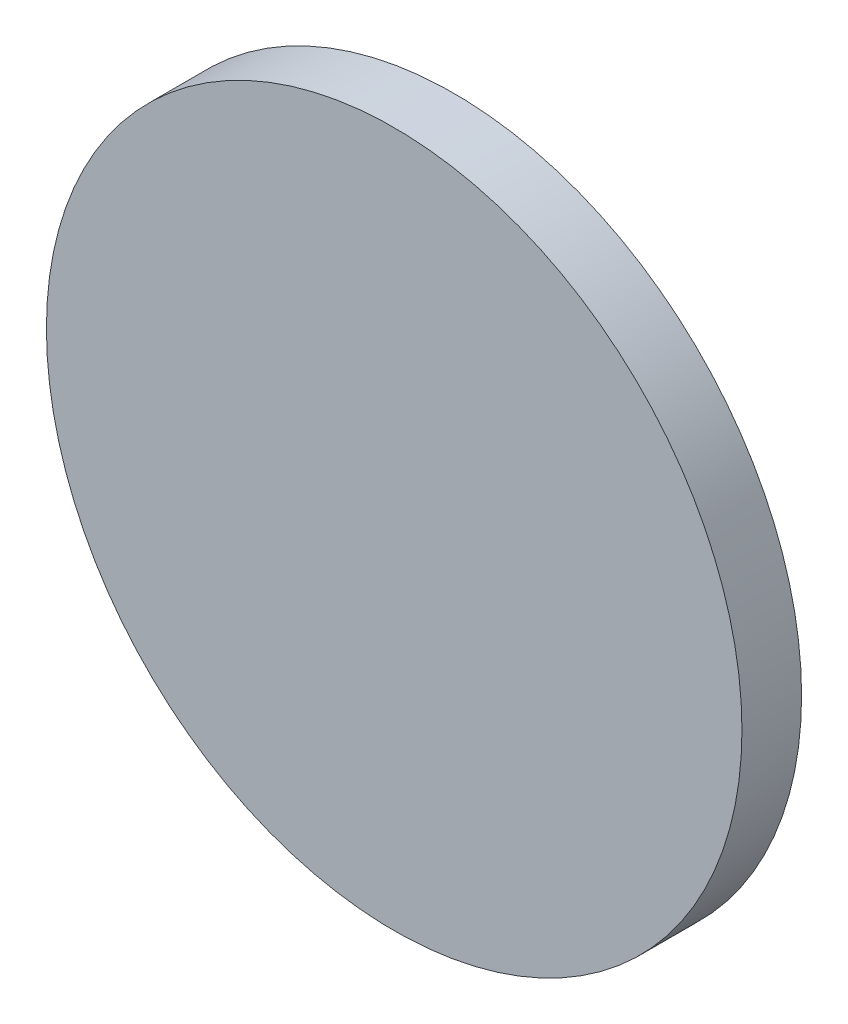
ISO-10303-21;
HEADER;
FILE_DESCRIPTION(('STEP AP214'),'2;1');
FILE_NAME('part.step','',(''),(''),'','','');
FILE_SCHEMA(('AUTOMOTIVE_DESIGN { 1 0 10303 214 1 1 1 1 }'));
ENDSEC;
DATA;
#1=APPLICATION_CONTEXT('core data for automotive mechanical design processes');
#2=APPLICATION_PROTOCOL_DEFINITION('international standard','automotive_design',2000,#1);
#3=PRODUCT_CONTEXT('',#1,'mechanical');
#4=PRODUCT('Part','Part','',(#3));
#5=PRODUCT_RELATED_PRODUCT_CATEGORY('part','',(#4));
#6=PRODUCT_DEFINITION_FORMATION('','',#4);
#7=PRODUCT_DEFINITION_CONTEXT('part definition',#1,'design');
#8=PRODUCT_DEFINITION('design','',#6,#7);
#9=PRODUCT_DEFINITION_SHAPE('','',#8);
#10=(LENGTH_UNIT() NAMED_UNIT(*) SI_UNIT(.MILLI.,.METRE.));
#11=(NAMED_UNIT(*) PLANE_ANGLE_UNIT() SI_UNIT($,.RADIAN.));
#12=(NAMED_UNIT(*) SI_UNIT($,.STERADIAN.) SOLID_ANGLE_UNIT());
#13=UNCERTAINTY_MEASURE_WITH_UNIT(LENGTH_MEASURE(1.E-05),#10,'distance_accuracy_value','');
#14=(GEOMETRIC_REPRESENTATION_CONTEXT(3) GLOBAL_UNCERTAINTY_ASSIGNED_CONTEXT((#13)) GLOBAL_UNIT_ASSIGNED_CONTEXT((#10,
#11,#12)) REPRESENTATION_CONTEXT('',''));
#15=CARTESIAN_POINT('',(0.,0.,0.));
#16=DIRECTION('',(0.,0.,1.));
#17=DIRECTION('',(1.,0.,0.));
#18=AXIS2_PLACEMENT_3D('',#15,#16,#17);
#19=CARTESIAN_POINT('',(5.3721,9.271,0.79916));
#20=DIRECTION('',(0.,0.,1.));
#21=DIRECTION('',(1.,0.,0.));
#22=AXIS2_PLACEMENT_3D('',#19,#20,#21);
#23=PLANE('',#22);
#24=CARTESIAN_POINT('',(5.3721,9.271,0.79916));
#25=DIRECTION('',(0.,0.,1.));
#26=DIRECTION('',(1.,0.,0.));
#27=AXIS2_PLACEMENT_3D('',#24,#25,#26);
#28=CIRCLE('',#27,0.200024667);
#29=CARTESIAN_POINT('',(5.572124667,9.271,0.79916));
#30=VERTEX_POINT('',#29);
#31=EDGE_CURVE('E18',#30,#30,#28,.F.);
#32=ORIENTED_EDGE('',*,*,#31,.F.);
#33=EDGE_LOOP('',(#32));
#34=FACE_BOUND('',#33,.T.);
#35=ADVANCED_FACE('F15',(#34),#23,.T.);
#36=CARTESIAN_POINT('',(5.3721,9.271,0.76487));
#37=DIRECTION('',(0.,0.,1.));
#38=DIRECTION('',(1.,0.,0.));
#39=AXIS2_PLACEMENT_3D('',#36,#37,#38);
#40=CYLINDRICAL_SURFACE('',#39,0.200024667);
#41=ORIENTED_EDGE('',*,*,#31,.T.);
#42=EDGE_LOOP('',(#41));
#43=FACE_BOUND('',#42,.T.);
#44=CARTESIAN_POINT('',(5.3721,9.271,0.76487));
#45=DIRECTION('',(0.,0.,1.));
#46=DIRECTION('',(1.,0.,0.));
#47=AXIS2_PLACEMENT_3D('',#44,#45,#46);
#48=CIRCLE('',#47,0.200024667);
#49=CARTESIAN_POINT('',(5.572124667,9.271,0.76487));
#50=VERTEX_POINT('',#49);
#51=EDGE_CURVE('E10',#50,#50,#48,.F.);
#52=ORIENTED_EDGE('',*,*,#51,.F.);
#53=EDGE_LOOP('',(#52));
#54=FACE_BOUND('',#53,.T.);
#55=ADVANCED_FACE('F27',(#43,#54),#40,.T.);
#56=CARTESIAN_POINT('',(5.3721,9.271,0.76487));
#57=DIRECTION('',(0.,0.,-1.));
#58=DIRECTION('',(-1.,0.,0.));
#59=AXIS2_PLACEMENT_3D('',#56,#57,#58);
#60=PLANE('',#59);
#61=ORIENTED_EDGE('',*,*,#51,.T.);
#62=EDGE_LOOP('',(#61));
#63=FACE_BOUND('',#62,.T.);
#64=ADVANCED_FACE('F35',(#63),#60,.T.);
#65=CLOSED_SHELL('',(#35,#55,#64));
#66=MANIFOLD_SOLID_BREP('B1',#65);
#67=ADVANCED_BREP_SHAPE_REPRESENTATION('',(#18,#66),#14);
#68=SHAPE_DEFINITION_REPRESENTATION(#9,#67);
ENDSEC;
END-ISO-10303-21;
